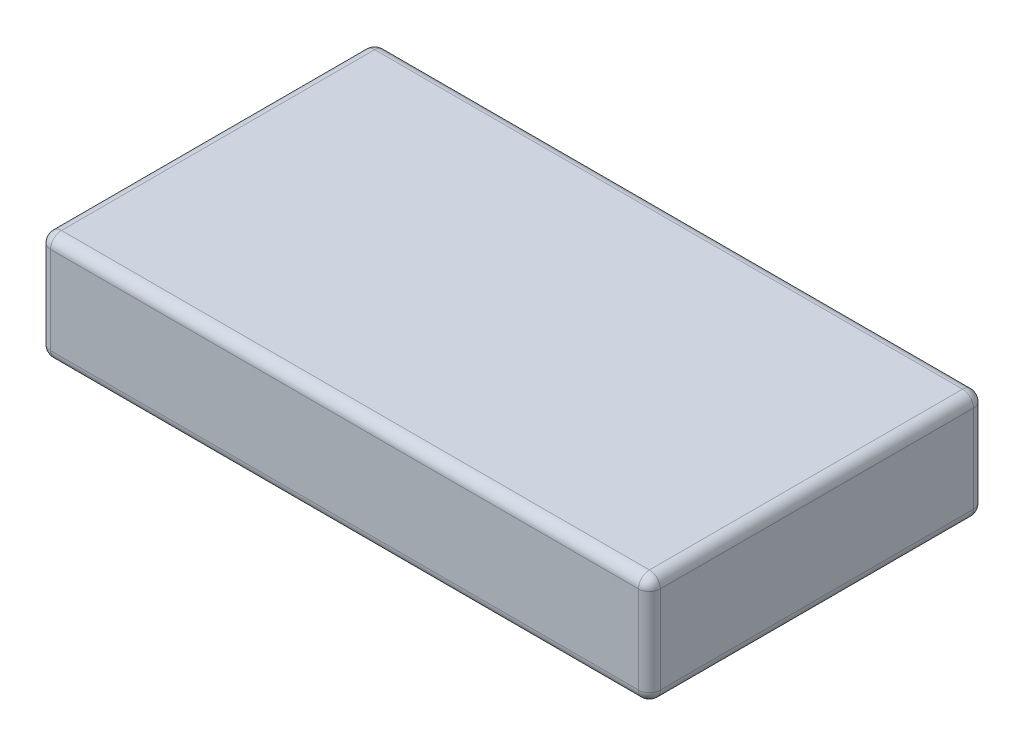
ISO-10303-21;
HEADER;
FILE_DESCRIPTION(('STEP AP214'),'2;1');
FILE_NAME('part.step','',(''),(''),'','','');
FILE_SCHEMA(('AUTOMOTIVE_DESIGN { 1 0 10303 214 1 1 1 1 }'));
ENDSEC;
DATA;
#1=APPLICATION_CONTEXT('core data for automotive mechanical design processes');
#2=APPLICATION_PROTOCOL_DEFINITION('international standard','automotive_design',2000,#1);
#3=PRODUCT_CONTEXT('',#1,'mechanical');
#4=PRODUCT('Part','Part','',(#3));
#5=PRODUCT_RELATED_PRODUCT_CATEGORY('part','',(#4));
#6=PRODUCT_DEFINITION_FORMATION('','',#4);
#7=PRODUCT_DEFINITION_CONTEXT('part definition',#1,'design');
#8=PRODUCT_DEFINITION('design','',#6,#7);
#9=PRODUCT_DEFINITION_SHAPE('','',#8);
#10=(LENGTH_UNIT() NAMED_UNIT(*) SI_UNIT(.MILLI.,.METRE.));
#11=(NAMED_UNIT(*) PLANE_ANGLE_UNIT() SI_UNIT($,.RADIAN.));
#12=(NAMED_UNIT(*) SI_UNIT($,.STERADIAN.) SOLID_ANGLE_UNIT());
#13=UNCERTAINTY_MEASURE_WITH_UNIT(LENGTH_MEASURE(1.E-05),#10,'distance_accuracy_value','');
#14=(GEOMETRIC_REPRESENTATION_CONTEXT(3) GLOBAL_UNCERTAINTY_ASSIGNED_CONTEXT((#13)) GLOBAL_UNIT_ASSIGNED_CONTEXT((#10,
#11,#12)) REPRESENTATION_CONTEXT('',''));
#15=CARTESIAN_POINT('',(0.,0.,0.));
#16=DIRECTION('',(0.,0.,1.));
#17=DIRECTION('',(1.,0.,0.));
#18=AXIS2_PLACEMENT_3D('',#15,#16,#17);
#19=CARTESIAN_POINT('',(0.,10.,0.));
#20=DIRECTION('',(1.,0.,0.));
#21=DIRECTION('',(0.,0.,-1.));
#22=AXIS2_PLACEMENT_3D('',#19,#20,#21);
#23=PLANE('',#22);
#24=DIRECTION('',(0.,0.,1.));
#25=VECTOR('',#24,1.);
#26=CARTESIAN_POINT('',(0.,9.,0.));
#27=LINE('',#26,#25);
#28=CARTESIAN_POINT('',(0.,9.,-1.));
#29=VERTEX_POINT('',#28);
#30=CARTESIAN_POINT('',(0.,9.,-29.6));
#31=VERTEX_POINT('',#30);
#32=EDGE_CURVE('E279',#29,#31,#27,.F.);
#33=ORIENTED_EDGE('',*,*,#32,.T.);
#34=DIRECTION('',(0.,-1.,0.));
#35=VECTOR('',#34,1.);
#36=CARTESIAN_POINT('',(0.,10.,-29.6));
#37=LINE('',#36,#35);
#38=CARTESIAN_POINT('',(0.,0.999999999999999,-29.6));
#39=VERTEX_POINT('',#38);
#40=EDGE_CURVE('E281',#31,#39,#37,.T.);
#41=ORIENTED_EDGE('',*,*,#40,.T.);
#42=DIRECTION('',(0.,0.,1.));
#43=VECTOR('',#42,1.);
#44=CARTESIAN_POINT('',(0.,0.999999999999999,0.));
#45=LINE('',#44,#43);
#46=CARTESIAN_POINT('',(0.,0.999999999999999,-1.));
#47=VERTEX_POINT('',#46);
#48=EDGE_CURVE('E276',#39,#47,#45,.T.);
#49=ORIENTED_EDGE('',*,*,#48,.T.);
#50=DIRECTION('',(0.,-1.,0.));
#51=VECTOR('',#50,1.);
#52=CARTESIAN_POINT('',(0.,10.,-1.));
#53=LINE('',#52,#51);
#54=EDGE_CURVE('E274',#47,#29,#53,.F.);
#55=ORIENTED_EDGE('',*,*,#54,.T.);
#56=EDGE_LOOP('',(#33,#41,#49,#55));
#57=FACE_BOUND('',#56,.T.);
#58=ADVANCED_FACE('F38',(#57),#23,.F.);
#59=CARTESIAN_POINT('',(0.,10.,0.));
#60=DIRECTION('',(0.,0.,-1.));
#61=DIRECTION('',(-1.,0.,0.));
#62=AXIS2_PLACEMENT_3D('',#59,#60,#61);
#63=PLANE('',#62);
#64=DIRECTION('',(1.,0.,0.));
#65=VECTOR('',#64,1.);
#66=CARTESIAN_POINT('',(0.,9.,0.));
#67=LINE('',#66,#65);
#68=CARTESIAN_POINT('',(54.7,9.,0.));
#69=VERTEX_POINT('',#68);
#70=CARTESIAN_POINT('',(1.,9.,0.));
#71=VERTEX_POINT('',#70);
#72=EDGE_CURVE('E48',#69,#71,#67,.F.);
#73=ORIENTED_EDGE('',*,*,#72,.T.);
#74=DIRECTION('',(0.,-1.,0.));
#75=VECTOR('',#74,1.);
#76=CARTESIAN_POINT('',(1.,10.,0.));
#77=LINE('',#76,#75);
#78=CARTESIAN_POINT('',(1.,0.999999999999999,0.));
#79=VERTEX_POINT('',#78);
#80=EDGE_CURVE('E11',#71,#79,#77,.T.);
#81=ORIENTED_EDGE('',*,*,#80,.T.);
#82=DIRECTION('',(1.,0.,0.));
#83=VECTOR('',#82,1.);
#84=CARTESIAN_POINT('',(55.7,0.999999999999999,0.));
#85=LINE('',#84,#83);
#86=CARTESIAN_POINT('',(54.7,0.999999999999999,0.));
#87=VERTEX_POINT('',#86);
#88=EDGE_CURVE('E285',#79,#87,#85,.T.);
#89=ORIENTED_EDGE('',*,*,#88,.T.);
#90=DIRECTION('',(0.,-1.,0.));
#91=VECTOR('',#90,1.);
#92=CARTESIAN_POINT('',(54.7,10.,0.));
#93=LINE('',#92,#91);
#94=EDGE_CURVE('E59',#87,#69,#93,.F.);
#95=ORIENTED_EDGE('',*,*,#94,.T.);
#96=EDGE_LOOP('',(#73,#81,#89,#95));
#97=FACE_BOUND('',#96,.T.);
#98=ADVANCED_FACE('F349',(#97),#63,.F.);
#99=CARTESIAN_POINT('',(55.7,10.,0.));
#100=DIRECTION('',(-1.,0.,0.));
#101=DIRECTION('',(0.,0.,1.));
#102=AXIS2_PLACEMENT_3D('',#99,#100,#101);
#103=PLANE('',#102);
#104=DIRECTION('',(0.,-1.,0.));
#105=VECTOR('',#104,1.);
#106=CARTESIAN_POINT('',(55.7,10.,-1.));
#107=LINE('',#106,#105);
#108=CARTESIAN_POINT('',(55.7,9.,-1.));
#109=VERTEX_POINT('',#108);
#110=CARTESIAN_POINT('',(55.7,0.999999999999999,-1.));
#111=VERTEX_POINT('',#110);
#112=EDGE_CURVE('E322',#109,#111,#107,.T.);
#113=ORIENTED_EDGE('',*,*,#112,.T.);
#114=DIRECTION('',(0.,0.,-1.));
#115=VECTOR('',#114,1.);
#116=CARTESIAN_POINT('',(55.7,0.999999999999999,-30.6));
#117=LINE('',#116,#115);
#118=CARTESIAN_POINT('',(55.7,0.999999999999999,-29.6));
#119=VERTEX_POINT('',#118);
#120=EDGE_CURVE('E256',#111,#119,#117,.T.);
#121=ORIENTED_EDGE('',*,*,#120,.T.);
#122=DIRECTION('',(0.,-1.,0.));
#123=VECTOR('',#122,1.);
#124=CARTESIAN_POINT('',(55.7,10.,-29.6));
#125=LINE('',#124,#123);
#126=CARTESIAN_POINT('',(55.7,9.,-29.6));
#127=VERTEX_POINT('',#126);
#128=EDGE_CURVE('E325',#119,#127,#125,.F.);
#129=ORIENTED_EDGE('',*,*,#128,.T.);
#130=DIRECTION('',(0.,0.,-1.));
#131=VECTOR('',#130,1.);
#132=CARTESIAN_POINT('',(55.7,9.,0.));
#133=LINE('',#132,#131);
#134=EDGE_CURVE('E317',#127,#109,#133,.F.);
#135=ORIENTED_EDGE('',*,*,#134,.T.);
#136=EDGE_LOOP('',(#113,#121,#129,#135));
#137=FACE_BOUND('',#136,.T.);
#138=ADVANCED_FACE('F326',(#137),#103,.F.);
#139=CARTESIAN_POINT('',(0.,10.,-30.6));
#140=DIRECTION('',(0.,0.,1.));
#141=DIRECTION('',(1.,0.,0.));
#142=AXIS2_PLACEMENT_3D('',#139,#140,#141);
#143=PLANE('',#142);
#144=DIRECTION('',(-1.,0.,0.));
#145=VECTOR('',#144,1.);
#146=CARTESIAN_POINT('',(0.,9.,-30.6));
#147=LINE('',#146,#145);
#148=CARTESIAN_POINT('',(1.,9.,-30.6));
#149=VERTEX_POINT('',#148);
#150=CARTESIAN_POINT('',(54.7,9.,-30.6));
#151=VERTEX_POINT('',#150);
#152=EDGE_CURVE('E150',#149,#151,#147,.F.);
#153=ORIENTED_EDGE('',*,*,#152,.T.);
#154=DIRECTION('',(0.,-1.,0.));
#155=VECTOR('',#154,1.);
#156=CARTESIAN_POINT('',(54.7,10.,-30.6));
#157=LINE('',#156,#155);
#158=CARTESIAN_POINT('',(54.7,0.999999999999999,-30.6));
#159=VERTEX_POINT('',#158);
#160=EDGE_CURVE('E145',#151,#159,#157,.T.);
#161=ORIENTED_EDGE('',*,*,#160,.T.);
#162=DIRECTION('',(-1.,0.,0.));
#163=VECTOR('',#162,1.);
#164=CARTESIAN_POINT('',(0.,0.999999999999999,-30.6));
#165=LINE('',#164,#163);
#166=CARTESIAN_POINT('',(1.,0.999999999999999,-30.6));
#167=VERTEX_POINT('',#166);
#168=EDGE_CURVE('E139',#159,#167,#165,.T.);
#169=ORIENTED_EDGE('',*,*,#168,.T.);
#170=DIRECTION('',(0.,-1.,0.));
#171=VECTOR('',#170,1.);
#172=CARTESIAN_POINT('',(1.,10.,-30.6));
#173=LINE('',#172,#171);
#174=EDGE_CURVE('E142',#167,#149,#173,.F.);
#175=ORIENTED_EDGE('',*,*,#174,.T.);
#176=EDGE_LOOP('',(#153,#161,#169,#175));
#177=FACE_BOUND('',#176,.T.);
#178=ADVANCED_FACE('F141',(#177),#143,.F.);
#179=CARTESIAN_POINT('',(0.,10.,0.));
#180=DIRECTION('',(0.,-1.,0.));
#181=DIRECTION('',(0.,0.,-1.));
#182=AXIS2_PLACEMENT_3D('',#179,#180,#181);
#183=PLANE('',#182);
#184=DIRECTION('',(0.,0.,-1.));
#185=VECTOR('',#184,1.);
#186=CARTESIAN_POINT('',(54.7,10.,0.));
#187=LINE('',#186,#185);
#188=CARTESIAN_POINT('',(54.7,10.,-1.));
#189=VERTEX_POINT('',#188);
#190=CARTESIAN_POINT('',(54.7,10.,-29.6));
#191=VERTEX_POINT('',#190);
#192=EDGE_CURVE('E250',#189,#191,#187,.T.);
#193=ORIENTED_EDGE('',*,*,#192,.T.);
#194=DIRECTION('',(-1.,0.,0.));
#195=VECTOR('',#194,1.);
#196=CARTESIAN_POINT('',(0.,10.,-29.6));
#197=LINE('',#196,#195);
#198=CARTESIAN_POINT('',(1.,10.,-29.6));
#199=VERTEX_POINT('',#198);
#200=EDGE_CURVE('E254',#191,#199,#197,.T.);
#201=ORIENTED_EDGE('',*,*,#200,.T.);
#202=DIRECTION('',(0.,0.,1.));
#203=VECTOR('',#202,1.);
#204=CARTESIAN_POINT('',(1.,10.,0.));
#205=LINE('',#204,#203);
#206=CARTESIAN_POINT('',(1.,10.,-1.));
#207=VERTEX_POINT('',#206);
#208=EDGE_CURVE('E249',#199,#207,#205,.T.);
#209=ORIENTED_EDGE('',*,*,#208,.T.);
#210=DIRECTION('',(1.,0.,0.));
#211=VECTOR('',#210,1.);
#212=CARTESIAN_POINT('',(0.,10.,-1.));
#213=LINE('',#212,#211);
#214=EDGE_CURVE('E245',#207,#189,#213,.T.);
#215=ORIENTED_EDGE('',*,*,#214,.T.);
#216=EDGE_LOOP('',(#193,#201,#209,#215));
#217=FACE_BOUND('',#216,.T.);
#218=ADVANCED_FACE('F343',(#217),#183,.F.);
#219=CARTESIAN_POINT('',(0.,0.,0.));
#220=DIRECTION('',(0.,-1.,0.));
#221=DIRECTION('',(0.,0.,-1.));
#222=AXIS2_PLACEMENT_3D('',#219,#220,#221);
#223=PLANE('',#222);
#224=DIRECTION('',(0.,0.,1.));
#225=VECTOR('',#224,1.);
#226=CARTESIAN_POINT('',(1.,0.,-30.6));
#227=LINE('',#226,#225);
#228=CARTESIAN_POINT('',(1.,0.,-1.));
#229=VERTEX_POINT('',#228);
#230=CARTESIAN_POINT('',(1.,0.,-29.6));
#231=VERTEX_POINT('',#230);
#232=EDGE_CURVE('E269',#229,#231,#227,.F.);
#233=ORIENTED_EDGE('',*,*,#232,.T.);
#234=DIRECTION('',(-1.,0.,0.));
#235=VECTOR('',#234,1.);
#236=CARTESIAN_POINT('',(55.7,0.,-29.6));
#237=LINE('',#236,#235);
#238=CARTESIAN_POINT('',(54.7,0.,-29.6));
#239=VERTEX_POINT('',#238);
#240=EDGE_CURVE('E174',#231,#239,#237,.F.);
#241=ORIENTED_EDGE('',*,*,#240,.T.);
#242=DIRECTION('',(0.,0.,-1.));
#243=VECTOR('',#242,1.);
#244=CARTESIAN_POINT('',(54.7,0.,0.));
#245=LINE('',#244,#243);
#246=CARTESIAN_POINT('',(54.7,0.,-1.));
#247=VERTEX_POINT('',#246);
#248=EDGE_CURVE('E263',#239,#247,#245,.F.);
#249=ORIENTED_EDGE('',*,*,#248,.T.);
#250=DIRECTION('',(1.,0.,0.));
#251=VECTOR('',#250,1.);
#252=CARTESIAN_POINT('',(0.,0.,-1.));
#253=LINE('',#252,#251);
#254=EDGE_CURVE('E266',#247,#229,#253,.F.);
#255=ORIENTED_EDGE('',*,*,#254,.T.);
#256=EDGE_LOOP('',(#233,#241,#249,#255));
#257=FACE_BOUND('',#256,.T.);
#258=ADVANCED_FACE('F383',(#257),#223,.T.);
#259=CARTESIAN_POINT('',(1.,10.,-1.));
#260=DIRECTION('',(0.,-1.,0.));
#261=DIRECTION('',(0.,0.,-1.));
#262=AXIS2_PLACEMENT_3D('',#259,#260,#261);
#263=CYLINDRICAL_SURFACE('',#262,1.);
#264=CARTESIAN_POINT('',(1.,9.,-1.));
#265=DIRECTION('',(0.,1.,0.));
#266=DIRECTION('',(0.,0.,1.));
#267=AXIS2_PLACEMENT_3D('',#264,#265,#266);
#268=CIRCLE('',#267,1.);
#269=EDGE_CURVE('E42',#29,#71,#268,.T.);
#270=ORIENTED_EDGE('',*,*,#269,.F.);
#271=ORIENTED_EDGE('',*,*,#54,.F.);
#272=CARTESIAN_POINT('',(1.,0.999999999999999,-1.));
#273=DIRECTION('',(0.,-1.,0.));
#274=DIRECTION('',(0.,0.,-1.));
#275=AXIS2_PLACEMENT_3D('',#272,#273,#274);
#276=CIRCLE('',#275,1.);
#277=EDGE_CURVE('E223',#79,#47,#276,.T.);
#278=ORIENTED_EDGE('',*,*,#277,.F.);
#279=ORIENTED_EDGE('',*,*,#80,.F.);
#280=EDGE_LOOP('',(#270,#271,#278,#279));
#281=FACE_BOUND('',#280,.T.);
#282=ADVANCED_FACE('F40',(#281),#263,.T.);
#283=CARTESIAN_POINT('',(1.,9.,-1.));
#284=DIRECTION('',(0.,0.,1.));
#285=DIRECTION('',(1.,0.,0.));
#286=AXIS2_PLACEMENT_3D('',#283,#284,#285);
#287=SPHERICAL_SURFACE('',#286,1.);
#288=CARTESIAN_POINT('',(1.,9.,-1.));
#289=DIRECTION('',(0.,0.,1.));
#290=DIRECTION('',(1.,0.,0.));
#291=AXIS2_PLACEMENT_3D('',#288,#289,#290);
#292=CIRCLE('',#291,1.);
#293=EDGE_CURVE('E218',#29,#207,#292,.F.);
#294=ORIENTED_EDGE('',*,*,#293,.F.);
#295=ORIENTED_EDGE('',*,*,#269,.T.);
#296=CARTESIAN_POINT('',(1.,9.,-1.));
#297=DIRECTION('',(-1.,0.,0.));
#298=DIRECTION('',(0.,0.,1.));
#299=AXIS2_PLACEMENT_3D('',#296,#297,#298);
#300=CIRCLE('',#299,1.);
#301=EDGE_CURVE('E221',#207,#71,#300,.F.);
#302=ORIENTED_EDGE('',*,*,#301,.F.);
#303=EDGE_LOOP('',(#294,#295,#302));
#304=FACE_BOUND('',#303,.T.);
#305=ADVANCED_FACE('F236',(#304),#287,.T.);
#306=CARTESIAN_POINT('',(1.,1.,-1.));
#307=DIRECTION('',(0.,0.,1.));
#308=DIRECTION('',(1.,0.,0.));
#309=AXIS2_PLACEMENT_3D('',#306,#307,#308);
#310=SPHERICAL_SURFACE('',#309,1.);
#311=CARTESIAN_POINT('',(1.,1.,-1.));
#312=DIRECTION('',(-1.,0.,0.));
#313=DIRECTION('',(0.,0.,1.));
#314=AXIS2_PLACEMENT_3D('',#311,#312,#313);
#315=CIRCLE('',#314,1.);
#316=EDGE_CURVE('E210',#79,#229,#315,.F.);
#317=ORIENTED_EDGE('',*,*,#316,.F.);
#318=ORIENTED_EDGE('',*,*,#277,.T.);
#319=CARTESIAN_POINT('',(1.,0.999999999999999,-1.));
#320=DIRECTION('',(0.,0.,1.));
#321=DIRECTION('',(1.,0.,0.));
#322=AXIS2_PLACEMENT_3D('',#319,#320,#321);
#323=CIRCLE('',#322,1.);
#324=EDGE_CURVE('E214',#229,#47,#323,.F.);
#325=ORIENTED_EDGE('',*,*,#324,.F.);
#326=EDGE_LOOP('',(#317,#318,#325));
#327=FACE_BOUND('',#326,.T.);
#328=ADVANCED_FACE('F405',(#327),#310,.T.);
#329=CARTESIAN_POINT('',(0.,9.,-1.));
#330=DIRECTION('',(1.,0.,0.));
#331=DIRECTION('',(0.,0.,-1.));
#332=AXIS2_PLACEMENT_3D('',#329,#330,#331);
#333=CYLINDRICAL_SURFACE('',#332,1.);
#334=ORIENTED_EDGE('',*,*,#301,.T.);
#335=ORIENTED_EDGE('',*,*,#72,.F.);
#336=CARTESIAN_POINT('',(54.7,9.,-1.));
#337=DIRECTION('',(1.,0.,0.));
#338=DIRECTION('',(0.,0.,-1.));
#339=AXIS2_PLACEMENT_3D('',#336,#337,#338);
#340=CIRCLE('',#339,1.);
#341=EDGE_CURVE('E204',#189,#69,#340,.T.);
#342=ORIENTED_EDGE('',*,*,#341,.F.);
#343=ORIENTED_EDGE('',*,*,#214,.F.);
#344=EDGE_LOOP('',(#334,#335,#342,#343));
#345=FACE_BOUND('',#344,.T.);
#346=ADVANCED_FACE('F242',(#345),#333,.T.);
#347=CARTESIAN_POINT('',(1.,9.,0.));
#348=DIRECTION('',(0.,0.,1.));
#349=DIRECTION('',(1.,0.,0.));
#350=AXIS2_PLACEMENT_3D('',#347,#348,#349);
#351=CYLINDRICAL_SURFACE('',#350,1.);
#352=ORIENTED_EDGE('',*,*,#293,.T.);
#353=ORIENTED_EDGE('',*,*,#208,.F.);
#354=CARTESIAN_POINT('',(1.,9.,-29.6));
#355=DIRECTION('',(0.,0.,-1.));
#356=DIRECTION('',(-1.,0.,0.));
#357=AXIS2_PLACEMENT_3D('',#354,#355,#356);
#358=CIRCLE('',#357,1.);
#359=EDGE_CURVE('E200',#31,#199,#358,.T.);
#360=ORIENTED_EDGE('',*,*,#359,.F.);
#361=ORIENTED_EDGE('',*,*,#32,.F.);
#362=EDGE_LOOP('',(#352,#353,#360,#361));
#363=FACE_BOUND('',#362,.T.);
#364=ADVANCED_FACE('F347',(#363),#351,.T.);
#365=CARTESIAN_POINT('',(1.,10.,-29.6));
#366=DIRECTION('',(0.,-1.,0.));
#367=DIRECTION('',(0.,0.,-1.));
#368=AXIS2_PLACEMENT_3D('',#365,#366,#367);
#369=CYLINDRICAL_SURFACE('',#368,1.);
#370=CARTESIAN_POINT('',(1.,0.999999999999999,-29.6));
#371=DIRECTION('',(0.,-1.,0.));
#372=DIRECTION('',(0.,0.,-1.));
#373=AXIS2_PLACEMENT_3D('',#370,#371,#372);
#374=CIRCLE('',#373,1.);
#375=EDGE_CURVE('E157',#39,#167,#374,.T.);
#376=ORIENTED_EDGE('',*,*,#375,.F.);
#377=ORIENTED_EDGE('',*,*,#40,.F.);
#378=CARTESIAN_POINT('',(1.,9.,-29.6));
#379=DIRECTION('',(0.,1.,0.));
#380=DIRECTION('',(0.,0.,1.));
#381=AXIS2_PLACEMENT_3D('',#378,#379,#380);
#382=CIRCLE('',#381,1.);
#383=EDGE_CURVE('E160',#149,#31,#382,.T.);
#384=ORIENTED_EDGE('',*,*,#383,.F.);
#385=ORIENTED_EDGE('',*,*,#174,.F.);
#386=EDGE_LOOP('',(#376,#377,#384,#385));
#387=FACE_BOUND('',#386,.T.);
#388=ADVANCED_FACE('F155',(#387),#369,.T.);
#389=CARTESIAN_POINT('',(1.,0.999999999999999,0.));
#390=DIRECTION('',(0.,0.,-1.));
#391=DIRECTION('',(-1.,0.,0.));
#392=AXIS2_PLACEMENT_3D('',#389,#390,#391);
#393=CYLINDRICAL_SURFACE('',#392,1.);
#394=ORIENTED_EDGE('',*,*,#324,.T.);
#395=ORIENTED_EDGE('',*,*,#48,.F.);
#396=CARTESIAN_POINT('',(1.,1.,-29.6));
#397=DIRECTION('',(0.,0.,-1.));
#398=DIRECTION('',(-1.,0.,0.));
#399=AXIS2_PLACEMENT_3D('',#396,#397,#398);
#400=CIRCLE('',#399,1.);
#401=EDGE_CURVE('E170',#231,#39,#400,.T.);
#402=ORIENTED_EDGE('',*,*,#401,.F.);
#403=ORIENTED_EDGE('',*,*,#232,.F.);
#404=EDGE_LOOP('',(#394,#395,#402,#403));
#405=FACE_BOUND('',#404,.T.);
#406=ADVANCED_FACE('F429',(#405),#393,.T.);
#407=CARTESIAN_POINT('',(0.,0.999999999999999,-1.));
#408=DIRECTION('',(-1.,0.,0.));
#409=DIRECTION('',(0.,0.,1.));
#410=AXIS2_PLACEMENT_3D('',#407,#408,#409);
#411=CYLINDRICAL_SURFACE('',#410,1.);
#412=ORIENTED_EDGE('',*,*,#316,.T.);
#413=ORIENTED_EDGE('',*,*,#254,.F.);
#414=CARTESIAN_POINT('',(54.7,0.999999999999999,-1.));
#415=DIRECTION('',(1.,0.,0.));
#416=DIRECTION('',(0.,0.,-1.));
#417=AXIS2_PLACEMENT_3D('',#414,#415,#416);
#418=CIRCLE('',#417,1.);
#419=EDGE_CURVE('E194',#87,#247,#418,.T.);
#420=ORIENTED_EDGE('',*,*,#419,.F.);
#421=ORIENTED_EDGE('',*,*,#88,.F.);
#422=EDGE_LOOP('',(#412,#413,#420,#421));
#423=FACE_BOUND('',#422,.T.);
#424=ADVANCED_FACE('F357',(#423),#411,.T.);
#425=CARTESIAN_POINT('',(54.7,10.,-1.));
#426=DIRECTION('',(0.,-1.,0.));
#427=DIRECTION('',(0.,0.,-1.));
#428=AXIS2_PLACEMENT_3D('',#425,#426,#427);
#429=CYLINDRICAL_SURFACE('',#428,1.);
#430=CARTESIAN_POINT('',(54.7,9.,-1.));
#431=DIRECTION('',(0.,1.,0.));
#432=DIRECTION('',(0.,0.,1.));
#433=AXIS2_PLACEMENT_3D('',#430,#431,#432);
#434=CIRCLE('',#433,1.);
#435=EDGE_CURVE('E207',#69,#109,#434,.T.);
#436=ORIENTED_EDGE('',*,*,#435,.F.);
#437=ORIENTED_EDGE('',*,*,#94,.F.);
#438=CARTESIAN_POINT('',(54.7,0.999999999999999,-1.));
#439=DIRECTION('',(0.,-1.,0.));
#440=DIRECTION('',(0.,0.,-1.));
#441=AXIS2_PLACEMENT_3D('',#438,#439,#440);
#442=CIRCLE('',#441,1.);
#443=EDGE_CURVE('E191',#111,#87,#442,.T.);
#444=ORIENTED_EDGE('',*,*,#443,.F.);
#445=ORIENTED_EDGE('',*,*,#112,.F.);
#446=EDGE_LOOP('',(#436,#437,#444,#445));
#447=FACE_BOUND('',#446,.T.);
#448=ADVANCED_FACE('F354',(#447),#429,.T.);
#449=CARTESIAN_POINT('',(54.7,9.,-1.));
#450=DIRECTION('',(0.,0.,1.));
#451=DIRECTION('',(1.,0.,0.));
#452=AXIS2_PLACEMENT_3D('',#449,#450,#451);
#453=SPHERICAL_SURFACE('',#452,1.);
#454=ORIENTED_EDGE('',*,*,#341,.T.);
#455=ORIENTED_EDGE('',*,*,#435,.T.);
#456=CARTESIAN_POINT('',(54.7,9.,-1.));
#457=DIRECTION('',(0.,0.,1.));
#458=DIRECTION('',(1.,0.,0.));
#459=AXIS2_PLACEMENT_3D('',#456,#457,#458);
#460=CIRCLE('',#459,1.);
#461=EDGE_CURVE('E182',#189,#109,#460,.F.);
#462=ORIENTED_EDGE('',*,*,#461,.F.);
#463=EDGE_LOOP('',(#454,#455,#462));
#464=FACE_BOUND('',#463,.T.);
#465=ADVANCED_FACE('F449',(#464),#453,.T.);
#466=CARTESIAN_POINT('',(1.,9.,-29.6));
#467=DIRECTION('',(0.,0.,1.));
#468=DIRECTION('',(1.,0.,0.));
#469=AXIS2_PLACEMENT_3D('',#466,#467,#468);
#470=SPHERICAL_SURFACE('',#469,1.);
#471=ORIENTED_EDGE('',*,*,#383,.T.);
#472=ORIENTED_EDGE('',*,*,#359,.T.);
#473=CARTESIAN_POINT('',(1.,9.,-29.6));
#474=DIRECTION('',(-1.,0.,0.));
#475=DIRECTION('',(0.,0.,1.));
#476=AXIS2_PLACEMENT_3D('',#473,#474,#475);
#477=CIRCLE('',#476,1.);
#478=EDGE_CURVE('E176',#149,#199,#477,.F.);
#479=ORIENTED_EDGE('',*,*,#478,.F.);
#480=EDGE_LOOP('',(#471,#472,#479));
#481=FACE_BOUND('',#480,.T.);
#482=ADVANCED_FACE('F456',(#481),#470,.T.);
#483=CARTESIAN_POINT('',(1.,1.,-29.6));
#484=DIRECTION('',(0.,0.,1.));
#485=DIRECTION('',(1.,0.,0.));
#486=AXIS2_PLACEMENT_3D('',#483,#484,#485);
#487=SPHERICAL_SURFACE('',#486,1.);
#488=ORIENTED_EDGE('',*,*,#401,.T.);
#489=ORIENTED_EDGE('',*,*,#375,.T.);
#490=CARTESIAN_POINT('',(1.,0.999999999999999,-29.6));
#491=DIRECTION('',(-1.,0.,0.));
#492=DIRECTION('',(0.,0.,1.));
#493=AXIS2_PLACEMENT_3D('',#490,#491,#492);
#494=CIRCLE('',#493,1.);
#495=EDGE_CURVE('E167',#231,#167,#494,.F.);
#496=ORIENTED_EDGE('',*,*,#495,.F.);
#497=EDGE_LOOP('',(#488,#489,#496));
#498=FACE_BOUND('',#497,.T.);
#499=ADVANCED_FACE('F166',(#498),#487,.T.);
#500=CARTESIAN_POINT('',(54.7,1.,-1.));
#501=DIRECTION('',(0.,0.,1.));
#502=DIRECTION('',(1.,0.,0.));
#503=AXIS2_PLACEMENT_3D('',#500,#501,#502);
#504=SPHERICAL_SURFACE('',#503,1.);
#505=ORIENTED_EDGE('',*,*,#443,.T.);
#506=ORIENTED_EDGE('',*,*,#419,.T.);
#507=CARTESIAN_POINT('',(54.7,1.,-1.));
#508=DIRECTION('',(0.,0.,1.));
#509=DIRECTION('',(1.,0.,0.));
#510=AXIS2_PLACEMENT_3D('',#507,#508,#509);
#511=CIRCLE('',#510,1.);
#512=EDGE_CURVE('E177',#111,#247,#511,.F.);
#513=ORIENTED_EDGE('',*,*,#512,.F.);
#514=EDGE_LOOP('',(#505,#506,#513));
#515=FACE_BOUND('',#514,.T.);
#516=ADVANCED_FACE('F359',(#515),#504,.T.);
#517=CARTESIAN_POINT('',(54.7,9.,0.));
#518=DIRECTION('',(0.,0.,-1.));
#519=DIRECTION('',(-1.,0.,0.));
#520=AXIS2_PLACEMENT_3D('',#517,#518,#519);
#521=CYLINDRICAL_SURFACE('',#520,1.);
#522=ORIENTED_EDGE('',*,*,#461,.T.);
#523=ORIENTED_EDGE('',*,*,#134,.F.);
#524=CARTESIAN_POINT('',(54.7,9.,-29.6));
#525=DIRECTION('',(0.,0.,-1.));
#526=DIRECTION('',(-1.,0.,0.));
#527=AXIS2_PLACEMENT_3D('',#524,#525,#526);
#528=CIRCLE('',#527,1.);
#529=EDGE_CURVE('E185',#191,#127,#528,.T.);
#530=ORIENTED_EDGE('',*,*,#529,.F.);
#531=ORIENTED_EDGE('',*,*,#192,.F.);
#532=EDGE_LOOP('',(#522,#523,#530,#531));
#533=FACE_BOUND('',#532,.T.);
#534=ADVANCED_FACE('F319',(#533),#521,.T.);
#535=CARTESIAN_POINT('',(0.,9.,-29.6));
#536=DIRECTION('',(-1.,0.,0.));
#537=DIRECTION('',(0.,0.,1.));
#538=AXIS2_PLACEMENT_3D('',#535,#536,#537);
#539=CYLINDRICAL_SURFACE('',#538,1.);
#540=ORIENTED_EDGE('',*,*,#478,.T.);
#541=ORIENTED_EDGE('',*,*,#200,.F.);
#542=CARTESIAN_POINT('',(54.7,9.,-29.6));
#543=DIRECTION('',(1.,0.,0.));
#544=DIRECTION('',(0.,0.,-1.));
#545=AXIS2_PLACEMENT_3D('',#542,#543,#544);
#546=CIRCLE('',#545,1.);
#547=EDGE_CURVE('E303',#151,#191,#546,.T.);
#548=ORIENTED_EDGE('',*,*,#547,.F.);
#549=ORIENTED_EDGE('',*,*,#152,.F.);
#550=EDGE_LOOP('',(#540,#541,#548,#549));
#551=FACE_BOUND('',#550,.T.);
#552=ADVANCED_FACE('F342',(#551),#539,.T.);
#553=CARTESIAN_POINT('',(0.,0.999999999999999,-29.6));
#554=DIRECTION('',(1.,0.,0.));
#555=DIRECTION('',(0.,0.,-1.));
#556=AXIS2_PLACEMENT_3D('',#553,#554,#555);
#557=CYLINDRICAL_SURFACE('',#556,1.);
#558=ORIENTED_EDGE('',*,*,#495,.T.);
#559=ORIENTED_EDGE('',*,*,#168,.F.);
#560=CARTESIAN_POINT('',(54.7,1.,-29.6));
#561=DIRECTION('',(1.,0.,0.));
#562=DIRECTION('',(0.,0.,-1.));
#563=AXIS2_PLACEMENT_3D('',#560,#561,#562);
#564=CIRCLE('',#563,1.);
#565=EDGE_CURVE('E299',#239,#159,#564,.T.);
#566=ORIENTED_EDGE('',*,*,#565,.F.);
#567=ORIENTED_EDGE('',*,*,#240,.F.);
#568=EDGE_LOOP('',(#558,#559,#566,#567));
#569=FACE_BOUND('',#568,.T.);
#570=ADVANCED_FACE('F172',(#569),#557,.T.);
#571=CARTESIAN_POINT('',(54.7,0.999999999999999,0.));
#572=DIRECTION('',(0.,0.,1.));
#573=DIRECTION('',(1.,0.,0.));
#574=AXIS2_PLACEMENT_3D('',#571,#572,#573);
#575=CYLINDRICAL_SURFACE('',#574,1.);
#576=ORIENTED_EDGE('',*,*,#512,.T.);
#577=ORIENTED_EDGE('',*,*,#248,.F.);
#578=CARTESIAN_POINT('',(54.7,0.999999999999999,-29.6));
#579=DIRECTION('',(0.,0.,-1.));
#580=DIRECTION('',(-1.,0.,0.));
#581=AXIS2_PLACEMENT_3D('',#578,#579,#580);
#582=CIRCLE('',#581,1.);
#583=EDGE_CURVE('E296',#119,#239,#582,.T.);
#584=ORIENTED_EDGE('',*,*,#583,.F.);
#585=ORIENTED_EDGE('',*,*,#120,.F.);
#586=EDGE_LOOP('',(#576,#577,#584,#585));
#587=FACE_BOUND('',#586,.T.);
#588=ADVANCED_FACE('F362',(#587),#575,.T.);
#589=CARTESIAN_POINT('',(54.7,9.,-29.6));
#590=DIRECTION('',(0.,0.,1.));
#591=DIRECTION('',(1.,0.,0.));
#592=AXIS2_PLACEMENT_3D('',#589,#590,#591);
#593=SPHERICAL_SURFACE('',#592,1.);
#594=ORIENTED_EDGE('',*,*,#547,.T.);
#595=ORIENTED_EDGE('',*,*,#529,.T.);
#596=CARTESIAN_POINT('',(54.7,9.,-29.6));
#597=DIRECTION('',(0.,1.,0.));
#598=DIRECTION('',(0.,0.,1.));
#599=AXIS2_PLACEMENT_3D('',#596,#597,#598);
#600=CIRCLE('',#599,1.);
#601=EDGE_CURVE('E293',#151,#127,#600,.F.);
#602=ORIENTED_EDGE('',*,*,#601,.F.);
#603=EDGE_LOOP('',(#594,#595,#602));
#604=FACE_BOUND('',#603,.T.);
#605=ADVANCED_FACE('F313',(#604),#593,.T.);
#606=CARTESIAN_POINT('',(54.7,1.,-29.6));
#607=DIRECTION('',(0.,0.,1.));
#608=DIRECTION('',(1.,0.,0.));
#609=AXIS2_PLACEMENT_3D('',#606,#607,#608);
#610=SPHERICAL_SURFACE('',#609,1.);
#611=ORIENTED_EDGE('',*,*,#583,.T.);
#612=ORIENTED_EDGE('',*,*,#565,.T.);
#613=CARTESIAN_POINT('',(54.7,0.999999999999999,-29.6));
#614=DIRECTION('',(0.,-1.,0.));
#615=DIRECTION('',(0.,0.,-1.));
#616=AXIS2_PLACEMENT_3D('',#613,#614,#615);
#617=CIRCLE('',#616,1.);
#618=EDGE_CURVE('E290',#119,#159,#617,.F.);
#619=ORIENTED_EDGE('',*,*,#618,.F.);
#620=EDGE_LOOP('',(#611,#612,#619));
#621=FACE_BOUND('',#620,.T.);
#622=ADVANCED_FACE('F364',(#621),#610,.T.);
#623=CARTESIAN_POINT('',(54.7,10.,-29.6));
#624=DIRECTION('',(0.,-1.,0.));
#625=DIRECTION('',(0.,0.,-1.));
#626=AXIS2_PLACEMENT_3D('',#623,#624,#625);
#627=CYLINDRICAL_SURFACE('',#626,1.);
#628=ORIENTED_EDGE('',*,*,#601,.T.);
#629=ORIENTED_EDGE('',*,*,#128,.F.);
#630=ORIENTED_EDGE('',*,*,#618,.T.);
#631=ORIENTED_EDGE('',*,*,#160,.F.);
#632=EDGE_LOOP('',(#628,#629,#630,#631));
#633=FACE_BOUND('',#632,.T.);
#634=ADVANCED_FACE('F365',(#633),#627,.T.);
#635=CLOSED_SHELL('',(#58,#98,#138,#178,#218,#258,#282,#305,#328,#346,#364,#388,#406,#424,#448,
#465,#482,#499,#516,#534,#552,#570,#588,#605,#622,#634));
#636=MANIFOLD_SOLID_BREP('B2',#635);
#637=ADVANCED_BREP_SHAPE_REPRESENTATION('',(#18,#636),#14);
#638=SHAPE_DEFINITION_REPRESENTATION(#9,#637);
ENDSEC;
END-ISO-10303-21;
